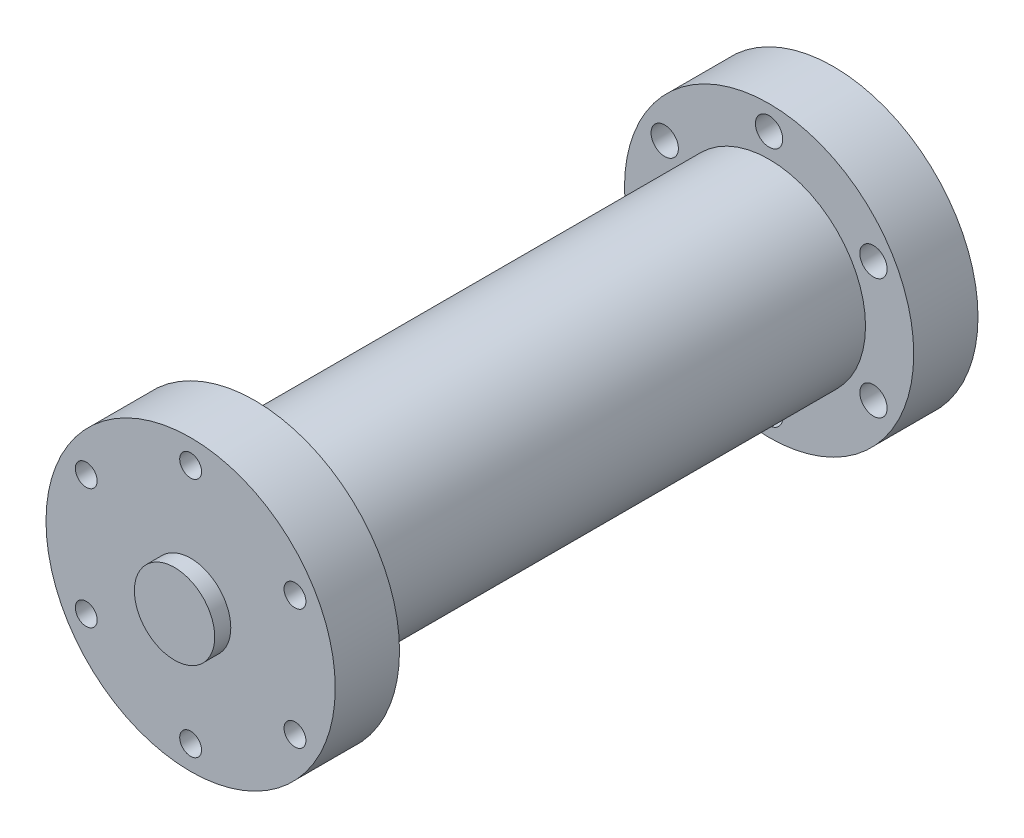
ISO-10303-21;
HEADER;
FILE_DESCRIPTION(('STEP AP214'),'2;1');
FILE_NAME('part.step','',(''),(''),'','','');
FILE_SCHEMA(('AUTOMOTIVE_DESIGN { 1 0 10303 214 1 1 1 1 }'));
ENDSEC;
DATA;
#1=APPLICATION_CONTEXT('core data for automotive mechanical design processes');
#2=APPLICATION_PROTOCOL_DEFINITION('international standard','automotive_design',2000,#1);
#3=PRODUCT_CONTEXT('',#1,'mechanical');
#4=PRODUCT('Part','Part','',(#3));
#5=PRODUCT_RELATED_PRODUCT_CATEGORY('part','',(#4));
#6=PRODUCT_DEFINITION_FORMATION('','',#4);
#7=PRODUCT_DEFINITION_CONTEXT('part definition',#1,'design');
#8=PRODUCT_DEFINITION('design','',#6,#7);
#9=PRODUCT_DEFINITION_SHAPE('','',#8);
#10=(LENGTH_UNIT() NAMED_UNIT(*) SI_UNIT(.MILLI.,.METRE.));
#11=(NAMED_UNIT(*) PLANE_ANGLE_UNIT() SI_UNIT($,.RADIAN.));
#12=(NAMED_UNIT(*) SI_UNIT($,.STERADIAN.) SOLID_ANGLE_UNIT());
#13=UNCERTAINTY_MEASURE_WITH_UNIT(LENGTH_MEASURE(1.E-05),#10,'distance_accuracy_value','');
#14=(GEOMETRIC_REPRESENTATION_CONTEXT(3) GLOBAL_UNCERTAINTY_ASSIGNED_CONTEXT((#13)) GLOBAL_UNIT_ASSIGNED_CONTEXT((#10,
#11,#12)) REPRESENTATION_CONTEXT('',''));
#15=CARTESIAN_POINT('',(0.,0.,0.));
#16=DIRECTION('',(0.,0.,1.));
#17=DIRECTION('',(1.,0.,0.));
#18=AXIS2_PLACEMENT_3D('',#15,#16,#17);
#19=CARTESIAN_POINT('',(0.,0.,20.));
#20=DIRECTION('',(0.,0.,-1.));
#21=DIRECTION('',(-1.,0.,0.));
#22=AXIS2_PLACEMENT_3D('',#19,#20,#21);
#23=CYLINDRICAL_SURFACE('',#22,45.);
#24=CARTESIAN_POINT('',(0.,0.,20.));
#25=DIRECTION('',(0.,0.,1.));
#26=DIRECTION('',(1.,0.,0.));
#27=AXIS2_PLACEMENT_3D('',#24,#25,#26);
#28=CIRCLE('',#27,45.);
#29=CARTESIAN_POINT('',(45.,0.,20.));
#30=VERTEX_POINT('',#29);
#31=EDGE_CURVE('E51',#30,#30,#28,.T.);
#32=ORIENTED_EDGE('',*,*,#31,.F.);
#33=EDGE_LOOP('',(#32));
#34=FACE_BOUND('',#33,.T.);
#35=CARTESIAN_POINT('',(0.,0.,0.));
#36=DIRECTION('',(0.,0.,1.));
#37=DIRECTION('',(1.,0.,0.));
#38=AXIS2_PLACEMENT_3D('',#35,#36,#37);
#39=CIRCLE('',#38,45.);
#40=CARTESIAN_POINT('',(45.,0.,0.));
#41=VERTEX_POINT('',#40);
#42=EDGE_CURVE('E40',#41,#41,#39,.T.);
#43=ORIENTED_EDGE('',*,*,#42,.T.);
#44=EDGE_LOOP('',(#43));
#45=FACE_BOUND('',#44,.T.);
#46=ADVANCED_FACE('F37',(#34,#45),#23,.T.);
#47=CARTESIAN_POINT('',(0.,0.,20.));
#48=DIRECTION('',(0.,0.,1.));
#49=DIRECTION('',(1.,0.,0.));
#50=AXIS2_PLACEMENT_3D('',#47,#48,#49);
#51=PLANE('',#50);
#52=CARTESIAN_POINT('',(32.4759526419162,18.7500000000004,20.));
#53=DIRECTION('',(0.,0.,1.));
#54=DIRECTION('',(1.,0.,0.));
#55=AXIS2_PLACEMENT_3D('',#52,#53,#54);
#56=CIRCLE('',#55,3.4);
#57=CARTESIAN_POINT('',(35.8759526419162,18.7500000000004,20.));
#58=VERTEX_POINT('',#57);
#59=EDGE_CURVE('E358',#58,#58,#56,.T.);
#60=ORIENTED_EDGE('',*,*,#59,.F.);
#61=EDGE_LOOP('',(#60));
#62=FACE_BOUND('',#61,.T.);
#63=CARTESIAN_POINT('',(32.4759526419166,-18.7499999999997,20.));
#64=DIRECTION('',(0.,0.,1.));
#65=DIRECTION('',(1.,0.,0.));
#66=AXIS2_PLACEMENT_3D('',#63,#64,#65);
#67=CIRCLE('',#66,3.4);
#68=CARTESIAN_POINT('',(35.8759526419166,-18.7499999999997,20.));
#69=VERTEX_POINT('',#68);
#70=EDGE_CURVE('E351',#69,#69,#67,.T.);
#71=ORIENTED_EDGE('',*,*,#70,.F.);
#72=EDGE_LOOP('',(#71));
#73=FACE_BOUND('',#72,.T.);
#74=CARTESIAN_POINT('',(0.,-37.5,20.));
#75=DIRECTION('',(0.,0.,1.));
#76=DIRECTION('',(1.,0.,0.));
#77=AXIS2_PLACEMENT_3D('',#74,#75,#76);
#78=CIRCLE('',#77,3.4);
#79=CARTESIAN_POINT('',(3.4,-37.5,20.));
#80=VERTEX_POINT('',#79);
#81=EDGE_CURVE('E343',#80,#80,#78,.T.);
#82=ORIENTED_EDGE('',*,*,#81,.F.);
#83=EDGE_LOOP('',(#82));
#84=FACE_BOUND('',#83,.T.);
#85=CARTESIAN_POINT('',(-32.4759526419164,-18.7500000000002,20.));
#86=DIRECTION('',(0.,0.,1.));
#87=DIRECTION('',(1.,0.,0.));
#88=AXIS2_PLACEMENT_3D('',#85,#86,#87);
#89=CIRCLE('',#88,3.4);
#90=CARTESIAN_POINT('',(-29.0759526419164,-18.7500000000002,20.));
#91=VERTEX_POINT('',#90);
#92=EDGE_CURVE('E335',#91,#91,#89,.T.);
#93=ORIENTED_EDGE('',*,*,#92,.F.);
#94=EDGE_LOOP('',(#93));
#95=FACE_BOUND('',#94,.T.);
#96=CARTESIAN_POINT('',(-32.4759526419165,18.7499999999999,20.));
#97=DIRECTION('',(0.,0.,1.));
#98=DIRECTION('',(1.,0.,0.));
#99=AXIS2_PLACEMENT_3D('',#96,#97,#98);
#100=CIRCLE('',#99,3.4);
#101=CARTESIAN_POINT('',(-29.0759526419165,18.7499999999999,20.));
#102=VERTEX_POINT('',#101);
#103=EDGE_CURVE('E327',#102,#102,#100,.T.);
#104=ORIENTED_EDGE('',*,*,#103,.F.);
#105=EDGE_LOOP('',(#104));
#106=FACE_BOUND('',#105,.T.);
#107=CARTESIAN_POINT('',(0.,37.5,20.));
#108=DIRECTION('',(0.,0.,1.));
#109=DIRECTION('',(1.,0.,0.));
#110=AXIS2_PLACEMENT_3D('',#107,#108,#109);
#111=CIRCLE('',#110,3.4);
#112=CARTESIAN_POINT('',(3.4,37.5,20.));
#113=VERTEX_POINT('',#112);
#114=EDGE_CURVE('E316',#113,#113,#111,.T.);
#115=ORIENTED_EDGE('',*,*,#114,.F.);
#116=EDGE_LOOP('',(#115));
#117=FACE_BOUND('',#116,.T.);
#118=CARTESIAN_POINT('',(0.,0.,20.));
#119=DIRECTION('',(0.,0.,1.));
#120=DIRECTION('',(1.,0.,0.));
#121=AXIS2_PLACEMENT_3D('',#118,#119,#120);
#122=CIRCLE('',#121,12.5);
#123=CARTESIAN_POINT('',(12.5,0.,20.));
#124=VERTEX_POINT('',#123);
#125=EDGE_CURVE('E10',#124,#124,#122,.T.);
#126=ORIENTED_EDGE('',*,*,#125,.F.);
#127=EDGE_LOOP('',(#126));
#128=FACE_BOUND('',#127,.T.);
#129=ORIENTED_EDGE('',*,*,#31,.T.);
#130=EDGE_LOOP('',(#129));
#131=FACE_BOUND('',#130,.T.);
#132=ADVANCED_FACE('F80',(#62,#73,#84,#95,#106,#117,#128,#131),#51,.T.);
#133=CARTESIAN_POINT('',(0.,0.,0.));
#134=DIRECTION('',(0.,0.,1.));
#135=DIRECTION('',(1.,0.,0.));
#136=AXIS2_PLACEMENT_3D('',#133,#134,#135);
#137=PLANE('',#136);
#138=CARTESIAN_POINT('',(32.4759526419162,18.7500000000004,0.));
#139=DIRECTION('',(0.,0.,1.));
#140=DIRECTION('',(1.,0.,0.));
#141=AXIS2_PLACEMENT_3D('',#138,#139,#140);
#142=CIRCLE('',#141,3.39999999999999);
#143=CARTESIAN_POINT('',(35.8759526419162,18.7500000000004,0.));
#144=VERTEX_POINT('',#143);
#145=EDGE_CURVE('E355',#144,#144,#142,.T.);
#146=ORIENTED_EDGE('',*,*,#145,.T.);
#147=EDGE_LOOP('',(#146));
#148=FACE_BOUND('',#147,.T.);
#149=CARTESIAN_POINT('',(32.4759526419166,-18.7499999999997,0.));
#150=DIRECTION('',(0.,0.,1.));
#151=DIRECTION('',(1.,0.,0.));
#152=AXIS2_PLACEMENT_3D('',#149,#150,#151);
#153=CIRCLE('',#152,3.39999999999999);
#154=CARTESIAN_POINT('',(35.8759526419166,-18.7499999999997,0.));
#155=VERTEX_POINT('',#154);
#156=EDGE_CURVE('E347',#155,#155,#153,.T.);
#157=ORIENTED_EDGE('',*,*,#156,.T.);
#158=EDGE_LOOP('',(#157));
#159=FACE_BOUND('',#158,.T.);
#160=CARTESIAN_POINT('',(0.,-37.5,0.));
#161=DIRECTION('',(0.,0.,1.));
#162=DIRECTION('',(1.,0.,0.));
#163=AXIS2_PLACEMENT_3D('',#160,#161,#162);
#164=CIRCLE('',#163,3.39999999999999);
#165=CARTESIAN_POINT('',(3.39999999999999,-37.5,0.));
#166=VERTEX_POINT('',#165);
#167=EDGE_CURVE('E339',#166,#166,#164,.T.);
#168=ORIENTED_EDGE('',*,*,#167,.T.);
#169=EDGE_LOOP('',(#168));
#170=FACE_BOUND('',#169,.T.);
#171=CARTESIAN_POINT('',(-32.4759526419164,-18.7500000000002,0.));
#172=DIRECTION('',(0.,0.,1.));
#173=DIRECTION('',(1.,0.,0.));
#174=AXIS2_PLACEMENT_3D('',#171,#172,#173);
#175=CIRCLE('',#174,3.39999999999998);
#176=CARTESIAN_POINT('',(-29.0759526419164,-18.7500000000002,0.));
#177=VERTEX_POINT('',#176);
#178=EDGE_CURVE('E331',#177,#177,#175,.T.);
#179=ORIENTED_EDGE('',*,*,#178,.T.);
#180=EDGE_LOOP('',(#179));
#181=FACE_BOUND('',#180,.T.);
#182=CARTESIAN_POINT('',(-32.4759526419165,18.7499999999999,0.));
#183=DIRECTION('',(0.,0.,1.));
#184=DIRECTION('',(1.,0.,0.));
#185=AXIS2_PLACEMENT_3D('',#182,#183,#184);
#186=CIRCLE('',#185,3.4);
#187=CARTESIAN_POINT('',(-29.0759526419165,18.7499999999999,0.));
#188=VERTEX_POINT('',#187);
#189=EDGE_CURVE('E321',#188,#188,#186,.T.);
#190=ORIENTED_EDGE('',*,*,#189,.T.);
#191=EDGE_LOOP('',(#190));
#192=FACE_BOUND('',#191,.T.);
#193=CARTESIAN_POINT('',(0.,37.5,0.));
#194=DIRECTION('',(0.,0.,1.));
#195=DIRECTION('',(1.,0.,0.));
#196=AXIS2_PLACEMENT_3D('',#193,#194,#195);
#197=CIRCLE('',#196,3.4);
#198=CARTESIAN_POINT('',(3.4,37.5,0.));
#199=VERTEX_POINT('',#198);
#200=EDGE_CURVE('E313',#199,#199,#197,.T.);
#201=ORIENTED_EDGE('',*,*,#200,.T.);
#202=EDGE_LOOP('',(#201));
#203=FACE_BOUND('',#202,.T.);
#204=CARTESIAN_POINT('',(0.,0.,0.));
#205=DIRECTION('',(0.,0.,-1.));
#206=DIRECTION('',(-1.,0.,0.));
#207=AXIS2_PLACEMENT_3D('',#204,#205,#206);
#208=CIRCLE('',#207,30.);
#209=CARTESIAN_POINT('',(-30.,0.,0.));
#210=VERTEX_POINT('',#209);
#211=EDGE_CURVE('E45',#210,#210,#208,.T.);
#212=ORIENTED_EDGE('',*,*,#211,.F.);
#213=EDGE_LOOP('',(#212));
#214=FACE_BOUND('',#213,.T.);
#215=ORIENTED_EDGE('',*,*,#42,.F.);
#216=EDGE_LOOP('',(#215));
#217=FACE_BOUND('',#216,.T.);
#218=ADVANCED_FACE('F77',(#148,#159,#170,#181,#192,#203,#214,#217),#137,.F.);
#219=CARTESIAN_POINT('',(0.,0.,-160.));
#220=DIRECTION('',(0.,0.,1.));
#221=DIRECTION('',(1.,0.,0.));
#222=AXIS2_PLACEMENT_3D('',#219,#220,#221);
#223=CYLINDRICAL_SURFACE('',#222,30.);
#224=CARTESIAN_POINT('',(0.,0.,-160.));
#225=DIRECTION('',(0.,0.,-1.));
#226=DIRECTION('',(-1.,0.,0.));
#227=AXIS2_PLACEMENT_3D('',#224,#225,#226);
#228=CIRCLE('',#227,30.);
#229=CARTESIAN_POINT('',(-30.,0.,-160.));
#230=VERTEX_POINT('',#229);
#231=EDGE_CURVE('E61',#230,#230,#228,.T.);
#232=ORIENTED_EDGE('',*,*,#231,.F.);
#233=EDGE_LOOP('',(#232));
#234=FACE_BOUND('',#233,.T.);
#235=ORIENTED_EDGE('',*,*,#211,.T.);
#236=EDGE_LOOP('',(#235));
#237=FACE_BOUND('',#236,.T.);
#238=ADVANCED_FACE('F79',(#234,#237),#223,.T.);
#239=CARTESIAN_POINT('',(0.,0.,-180.));
#240=DIRECTION('',(0.,0.,1.));
#241=DIRECTION('',(1.,0.,0.));
#242=AXIS2_PLACEMENT_3D('',#239,#240,#241);
#243=CYLINDRICAL_SURFACE('',#242,45.);
#244=CARTESIAN_POINT('',(0.,0.,-180.));
#245=DIRECTION('',(0.,0.,-1.));
#246=DIRECTION('',(-1.,0.,0.));
#247=AXIS2_PLACEMENT_3D('',#244,#245,#246);
#248=CIRCLE('',#247,45.);
#249=CARTESIAN_POINT('',(-45.,0.,-180.));
#250=VERTEX_POINT('',#249);
#251=EDGE_CURVE('E57',#250,#250,#248,.T.);
#252=ORIENTED_EDGE('',*,*,#251,.F.);
#253=EDGE_LOOP('',(#252));
#254=FACE_BOUND('',#253,.T.);
#255=CARTESIAN_POINT('',(0.,0.,-160.));
#256=DIRECTION('',(0.,0.,-1.));
#257=DIRECTION('',(-1.,0.,0.));
#258=AXIS2_PLACEMENT_3D('',#255,#256,#257);
#259=CIRCLE('',#258,45.);
#260=CARTESIAN_POINT('',(-45.,0.,-160.));
#261=VERTEX_POINT('',#260);
#262=EDGE_CURVE('E62',#261,#261,#259,.T.);
#263=ORIENTED_EDGE('',*,*,#262,.T.);
#264=EDGE_LOOP('',(#263));
#265=FACE_BOUND('',#264,.T.);
#266=ADVANCED_FACE('F86',(#254,#265),#243,.T.);
#267=CARTESIAN_POINT('',(0.,0.,-180.));
#268=DIRECTION('',(0.,0.,-1.));
#269=DIRECTION('',(-1.,0.,0.));
#270=AXIS2_PLACEMENT_3D('',#267,#268,#269);
#271=PLANE('',#270);
#272=CARTESIAN_POINT('',(0.,0.,-180.));
#273=DIRECTION('',(0.,0.,-1.));
#274=DIRECTION('',(-1.,0.,0.));
#275=AXIS2_PLACEMENT_3D('',#272,#273,#274);
#276=CIRCLE('',#275,12.5);
#277=CARTESIAN_POINT('',(-12.5,0.,-180.));
#278=VERTEX_POINT('',#277);
#279=EDGE_CURVE('E411',#278,#278,#276,.T.);
#280=ORIENTED_EDGE('',*,*,#279,.F.);
#281=EDGE_LOOP('',(#280));
#282=FACE_BOUND('',#281,.T.);
#283=CARTESIAN_POINT('',(-32.4759526419162,18.7500000000004,-180.));
#284=DIRECTION('',(0.,0.,-1.));
#285=DIRECTION('',(-1.,0.,0.));
#286=AXIS2_PLACEMENT_3D('',#283,#284,#285);
#287=CIRCLE('',#286,4.25);
#288=CARTESIAN_POINT('',(-36.7259526419162,18.7500000000004,-180.));
#289=VERTEX_POINT('',#288);
#290=EDGE_CURVE('E406',#289,#289,#287,.T.);
#291=ORIENTED_EDGE('',*,*,#290,.F.);
#292=EDGE_LOOP('',(#291));
#293=FACE_BOUND('',#292,.T.);
#294=CARTESIAN_POINT('',(-32.4759526419166,-18.7499999999997,-180.));
#295=DIRECTION('',(0.,0.,-1.));
#296=DIRECTION('',(-1.,0.,0.));
#297=AXIS2_PLACEMENT_3D('',#294,#295,#296);
#298=CIRCLE('',#297,4.25);
#299=CARTESIAN_POINT('',(-36.7259526419166,-18.7499999999997,-180.));
#300=VERTEX_POINT('',#299);
#301=EDGE_CURVE('E398',#300,#300,#298,.T.);
#302=ORIENTED_EDGE('',*,*,#301,.F.);
#303=EDGE_LOOP('',(#302));
#304=FACE_BOUND('',#303,.T.);
#305=CARTESIAN_POINT('',(0.,-37.5,-180.));
#306=DIRECTION('',(0.,0.,-1.));
#307=DIRECTION('',(-1.,0.,0.));
#308=AXIS2_PLACEMENT_3D('',#305,#306,#307);
#309=CIRCLE('',#308,4.25);
#310=CARTESIAN_POINT('',(-4.25,-37.5,-180.));
#311=VERTEX_POINT('',#310);
#312=EDGE_CURVE('E390',#311,#311,#309,.T.);
#313=ORIENTED_EDGE('',*,*,#312,.F.);
#314=EDGE_LOOP('',(#313));
#315=FACE_BOUND('',#314,.T.);
#316=CARTESIAN_POINT('',(32.4759526419164,-18.7500000000002,-180.));
#317=DIRECTION('',(0.,0.,-1.));
#318=DIRECTION('',(-1.,0.,0.));
#319=AXIS2_PLACEMENT_3D('',#316,#317,#318);
#320=CIRCLE('',#319,4.25);
#321=CARTESIAN_POINT('',(28.2259526419164,-18.7500000000002,-180.));
#322=VERTEX_POINT('',#321);
#323=EDGE_CURVE('E382',#322,#322,#320,.T.);
#324=ORIENTED_EDGE('',*,*,#323,.F.);
#325=EDGE_LOOP('',(#324));
#326=FACE_BOUND('',#325,.T.);
#327=CARTESIAN_POINT('',(32.4759526419165,18.7499999999999,-180.));
#328=DIRECTION('',(0.,0.,-1.));
#329=DIRECTION('',(-1.,0.,0.));
#330=AXIS2_PLACEMENT_3D('',#327,#328,#329);
#331=CIRCLE('',#330,4.25);
#332=CARTESIAN_POINT('',(28.2259526419165,18.7499999999999,-180.));
#333=VERTEX_POINT('',#332);
#334=EDGE_CURVE('E374',#333,#333,#331,.T.);
#335=ORIENTED_EDGE('',*,*,#334,.F.);
#336=EDGE_LOOP('',(#335));
#337=FACE_BOUND('',#336,.T.);
#338=CARTESIAN_POINT('',(0.,37.5,-180.));
#339=DIRECTION('',(0.,0.,-1.));
#340=DIRECTION('',(-1.,0.,0.));
#341=AXIS2_PLACEMENT_3D('',#338,#339,#340);
#342=CIRCLE('',#341,4.25);
#343=CARTESIAN_POINT('',(-4.25,37.5,-180.));
#344=VERTEX_POINT('',#343);
#345=EDGE_CURVE('E366',#344,#344,#342,.T.);
#346=ORIENTED_EDGE('',*,*,#345,.F.);
#347=EDGE_LOOP('',(#346));
#348=FACE_BOUND('',#347,.T.);
#349=ORIENTED_EDGE('',*,*,#251,.T.);
#350=EDGE_LOOP('',(#349));
#351=FACE_BOUND('',#350,.T.);
#352=ADVANCED_FACE('F187',(#282,#293,#304,#315,#326,#337,#348,#351),#271,.T.);
#353=CARTESIAN_POINT('',(0.,0.,-160.));
#354=DIRECTION('',(0.,0.,-1.));
#355=DIRECTION('',(-1.,0.,0.));
#356=AXIS2_PLACEMENT_3D('',#353,#354,#355);
#357=PLANE('',#356);
#358=CARTESIAN_POINT('',(-32.4759526419162,18.7500000000004,-160.));
#359=DIRECTION('',(0.,0.,-1.));
#360=DIRECTION('',(-1.,0.,0.));
#361=AXIS2_PLACEMENT_3D('',#358,#359,#360);
#362=CIRCLE('',#361,4.25);
#363=CARTESIAN_POINT('',(-36.7259526419162,18.7500000000004,-160.));
#364=VERTEX_POINT('',#363);
#365=EDGE_CURVE('E402',#364,#364,#362,.T.);
#366=ORIENTED_EDGE('',*,*,#365,.T.);
#367=EDGE_LOOP('',(#366));
#368=FACE_BOUND('',#367,.T.);
#369=CARTESIAN_POINT('',(-32.4759526419166,-18.7499999999997,-160.));
#370=DIRECTION('',(0.,0.,-1.));
#371=DIRECTION('',(-1.,0.,0.));
#372=AXIS2_PLACEMENT_3D('',#369,#370,#371);
#373=CIRCLE('',#372,4.25);
#374=CARTESIAN_POINT('',(-36.7259526419166,-18.7499999999997,-160.));
#375=VERTEX_POINT('',#374);
#376=EDGE_CURVE('E394',#375,#375,#373,.T.);
#377=ORIENTED_EDGE('',*,*,#376,.T.);
#378=EDGE_LOOP('',(#377));
#379=FACE_BOUND('',#378,.T.);
#380=CARTESIAN_POINT('',(0.,-37.5,-160.));
#381=DIRECTION('',(0.,0.,-1.));
#382=DIRECTION('',(-1.,0.,0.));
#383=AXIS2_PLACEMENT_3D('',#380,#381,#382);
#384=CIRCLE('',#383,4.25);
#385=CARTESIAN_POINT('',(-4.25,-37.5,-160.));
#386=VERTEX_POINT('',#385);
#387=EDGE_CURVE('E386',#386,#386,#384,.T.);
#388=ORIENTED_EDGE('',*,*,#387,.T.);
#389=EDGE_LOOP('',(#388));
#390=FACE_BOUND('',#389,.T.);
#391=CARTESIAN_POINT('',(32.4759526419164,-18.7500000000002,-160.));
#392=DIRECTION('',(0.,0.,-1.));
#393=DIRECTION('',(-1.,0.,0.));
#394=AXIS2_PLACEMENT_3D('',#391,#392,#393);
#395=CIRCLE('',#394,4.25);
#396=CARTESIAN_POINT('',(28.2259526419164,-18.7500000000002,-160.));
#397=VERTEX_POINT('',#396);
#398=EDGE_CURVE('E378',#397,#397,#395,.T.);
#399=ORIENTED_EDGE('',*,*,#398,.T.);
#400=EDGE_LOOP('',(#399));
#401=FACE_BOUND('',#400,.T.);
#402=CARTESIAN_POINT('',(32.4759526419165,18.7499999999999,-160.));
#403=DIRECTION('',(0.,0.,-1.));
#404=DIRECTION('',(-1.,0.,0.));
#405=AXIS2_PLACEMENT_3D('',#402,#403,#404);
#406=CIRCLE('',#405,4.25);
#407=CARTESIAN_POINT('',(28.2259526419165,18.7499999999999,-160.));
#408=VERTEX_POINT('',#407);
#409=EDGE_CURVE('E370',#408,#408,#406,.T.);
#410=ORIENTED_EDGE('',*,*,#409,.T.);
#411=EDGE_LOOP('',(#410));
#412=FACE_BOUND('',#411,.T.);
#413=CARTESIAN_POINT('',(0.,37.5,-160.));
#414=DIRECTION('',(0.,0.,-1.));
#415=DIRECTION('',(-1.,0.,0.));
#416=AXIS2_PLACEMENT_3D('',#413,#414,#415);
#417=CIRCLE('',#416,4.25);
#418=CARTESIAN_POINT('',(-4.25,37.5,-160.));
#419=VERTEX_POINT('',#418);
#420=EDGE_CURVE('E362',#419,#419,#417,.T.);
#421=ORIENTED_EDGE('',*,*,#420,.T.);
#422=EDGE_LOOP('',(#421));
#423=FACE_BOUND('',#422,.T.);
#424=ORIENTED_EDGE('',*,*,#231,.T.);
#425=EDGE_LOOP('',(#424));
#426=FACE_BOUND('',#425,.T.);
#427=ORIENTED_EDGE('',*,*,#262,.F.);
#428=EDGE_LOOP('',(#427));
#429=FACE_BOUND('',#428,.T.);
#430=ADVANCED_FACE('F181',(#368,#379,#390,#401,#412,#423,#426,#429),#357,.F.);
#431=CARTESIAN_POINT('',(0.,0.,25.));
#432=DIRECTION('',(0.,0.,-1.));
#433=DIRECTION('',(-1.,0.,0.));
#434=AXIS2_PLACEMENT_3D('',#431,#432,#433);
#435=CYLINDRICAL_SURFACE('',#434,12.5);
#436=CARTESIAN_POINT('',(0.,0.,25.));
#437=DIRECTION('',(0.,0.,1.));
#438=DIRECTION('',(1.,0.,0.));
#439=AXIS2_PLACEMENT_3D('',#436,#437,#438);
#440=CIRCLE('',#439,12.5);
#441=CARTESIAN_POINT('',(12.5,0.,25.));
#442=VERTEX_POINT('',#441);
#443=EDGE_CURVE('E55',#442,#442,#440,.T.);
#444=ORIENTED_EDGE('',*,*,#443,.F.);
#445=EDGE_LOOP('',(#444));
#446=FACE_BOUND('',#445,.T.);
#447=ORIENTED_EDGE('',*,*,#125,.T.);
#448=EDGE_LOOP('',(#447));
#449=FACE_BOUND('',#448,.T.);
#450=ADVANCED_FACE('F186',(#446,#449),#435,.T.);
#451=CARTESIAN_POINT('',(0.,0.,25.));
#452=DIRECTION('',(0.,0.,1.));
#453=DIRECTION('',(1.,0.,0.));
#454=AXIS2_PLACEMENT_3D('',#451,#452,#453);
#455=PLANE('',#454);
#456=ORIENTED_EDGE('',*,*,#443,.T.);
#457=EDGE_LOOP('',(#456));
#458=FACE_BOUND('',#457,.T.);
#459=ADVANCED_FACE('F275',(#458),#455,.T.);
#460=CARTESIAN_POINT('',(0.,37.5,20.));
#461=DIRECTION('',(0.,0.,1.));
#462=DIRECTION('',(1.,0.,0.));
#463=AXIS2_PLACEMENT_3D('',#460,#461,#462);
#464=CYLINDRICAL_SURFACE('',#463,3.4);
#465=ORIENTED_EDGE('',*,*,#200,.F.);
#466=EDGE_LOOP('',(#465));
#467=FACE_BOUND('',#466,.T.);
#468=ORIENTED_EDGE('',*,*,#114,.T.);
#469=EDGE_LOOP('',(#468));
#470=FACE_BOUND('',#469,.T.);
#471=ADVANCED_FACE('F108',(#467,#470),#464,.F.);
#472=CARTESIAN_POINT('',(-32.4759526419165,18.7499999999999,20.));
#473=DIRECTION('',(0.,0.,1.));
#474=DIRECTION('',(1.,0.,0.));
#475=AXIS2_PLACEMENT_3D('',#472,#473,#474);
#476=CYLINDRICAL_SURFACE('',#475,3.4);
#477=ORIENTED_EDGE('',*,*,#189,.F.);
#478=EDGE_LOOP('',(#477));
#479=FACE_BOUND('',#478,.T.);
#480=ORIENTED_EDGE('',*,*,#103,.T.);
#481=EDGE_LOOP('',(#480));
#482=FACE_BOUND('',#481,.T.);
#483=ADVANCED_FACE('F118',(#479,#482),#476,.F.);
#484=CARTESIAN_POINT('',(-32.4759526419164,-18.7500000000002,20.));
#485=DIRECTION('',(0.,0.,1.));
#486=DIRECTION('',(1.,0.,0.));
#487=AXIS2_PLACEMENT_3D('',#484,#485,#486);
#488=CYLINDRICAL_SURFACE('',#487,3.39999999999998);
#489=ORIENTED_EDGE('',*,*,#178,.F.);
#490=EDGE_LOOP('',(#489));
#491=FACE_BOUND('',#490,.T.);
#492=ORIENTED_EDGE('',*,*,#92,.T.);
#493=EDGE_LOOP('',(#492));
#494=FACE_BOUND('',#493,.T.);
#495=ADVANCED_FACE('F123',(#491,#494),#488,.F.);
#496=CARTESIAN_POINT('',(0.,-37.5,20.));
#497=DIRECTION('',(0.,0.,1.));
#498=DIRECTION('',(1.,0.,0.));
#499=AXIS2_PLACEMENT_3D('',#496,#497,#498);
#500=CYLINDRICAL_SURFACE('',#499,3.39999999999999);
#501=ORIENTED_EDGE('',*,*,#167,.F.);
#502=EDGE_LOOP('',(#501));
#503=FACE_BOUND('',#502,.T.);
#504=ORIENTED_EDGE('',*,*,#81,.T.);
#505=EDGE_LOOP('',(#504));
#506=FACE_BOUND('',#505,.T.);
#507=ADVANCED_FACE('F133',(#503,#506),#500,.F.);
#508=CARTESIAN_POINT('',(32.4759526419166,-18.7499999999997,20.));
#509=DIRECTION('',(0.,0.,1.));
#510=DIRECTION('',(1.,0.,0.));
#511=AXIS2_PLACEMENT_3D('',#508,#509,#510);
#512=CYLINDRICAL_SURFACE('',#511,3.39999999999999);
#513=ORIENTED_EDGE('',*,*,#156,.F.);
#514=EDGE_LOOP('',(#513));
#515=FACE_BOUND('',#514,.T.);
#516=ORIENTED_EDGE('',*,*,#70,.T.);
#517=EDGE_LOOP('',(#516));
#518=FACE_BOUND('',#517,.T.);
#519=ADVANCED_FACE('F143',(#515,#518),#512,.F.);
#520=CARTESIAN_POINT('',(32.4759526419162,18.7500000000004,20.));
#521=DIRECTION('',(0.,0.,1.));
#522=DIRECTION('',(1.,0.,0.));
#523=AXIS2_PLACEMENT_3D('',#520,#521,#522);
#524=CYLINDRICAL_SURFACE('',#523,3.39999999999999);
#525=ORIENTED_EDGE('',*,*,#145,.F.);
#526=EDGE_LOOP('',(#525));
#527=FACE_BOUND('',#526,.T.);
#528=ORIENTED_EDGE('',*,*,#59,.T.);
#529=EDGE_LOOP('',(#528));
#530=FACE_BOUND('',#529,.T.);
#531=ADVANCED_FACE('F153',(#527,#530),#524,.F.);
#532=CARTESIAN_POINT('',(0.,37.5,-180.));
#533=DIRECTION('',(0.,0.,-1.));
#534=DIRECTION('',(-1.,0.,0.));
#535=AXIS2_PLACEMENT_3D('',#532,#533,#534);
#536=CYLINDRICAL_SURFACE('',#535,4.25);
#537=ORIENTED_EDGE('',*,*,#420,.F.);
#538=EDGE_LOOP('',(#537));
#539=FACE_BOUND('',#538,.T.);
#540=ORIENTED_EDGE('',*,*,#345,.T.);
#541=EDGE_LOOP('',(#540));
#542=FACE_BOUND('',#541,.T.);
#543=ADVANCED_FACE('F163',(#539,#542),#536,.F.);
#544=CARTESIAN_POINT('',(32.4759526419165,18.7499999999999,-180.));
#545=DIRECTION('',(0.,0.,-1.));
#546=DIRECTION('',(-1.,0.,0.));
#547=AXIS2_PLACEMENT_3D('',#544,#545,#546);
#548=CYLINDRICAL_SURFACE('',#547,4.25);
#549=ORIENTED_EDGE('',*,*,#409,.F.);
#550=EDGE_LOOP('',(#549));
#551=FACE_BOUND('',#550,.T.);
#552=ORIENTED_EDGE('',*,*,#334,.T.);
#553=EDGE_LOOP('',(#552));
#554=FACE_BOUND('',#553,.T.);
#555=ADVANCED_FACE('F173',(#551,#554),#548,.F.);
#556=CARTESIAN_POINT('',(32.4759526419164,-18.7500000000002,-180.));
#557=DIRECTION('',(0.,0.,-1.));
#558=DIRECTION('',(-1.,0.,0.));
#559=AXIS2_PLACEMENT_3D('',#556,#557,#558);
#560=CYLINDRICAL_SURFACE('',#559,4.25);
#561=ORIENTED_EDGE('',*,*,#398,.F.);
#562=EDGE_LOOP('',(#561));
#563=FACE_BOUND('',#562,.T.);
#564=ORIENTED_EDGE('',*,*,#323,.T.);
#565=EDGE_LOOP('',(#564));
#566=FACE_BOUND('',#565,.T.);
#567=ADVANCED_FACE('F199',(#563,#566),#560,.F.);
#568=CARTESIAN_POINT('',(0.,-37.5,-180.));
#569=DIRECTION('',(0.,0.,-1.));
#570=DIRECTION('',(-1.,0.,0.));
#571=AXIS2_PLACEMENT_3D('',#568,#569,#570);
#572=CYLINDRICAL_SURFACE('',#571,4.25);
#573=ORIENTED_EDGE('',*,*,#387,.F.);
#574=EDGE_LOOP('',(#573));
#575=FACE_BOUND('',#574,.T.);
#576=ORIENTED_EDGE('',*,*,#312,.T.);
#577=EDGE_LOOP('',(#576));
#578=FACE_BOUND('',#577,.T.);
#579=ADVANCED_FACE('F209',(#575,#578),#572,.F.);
#580=CARTESIAN_POINT('',(-32.4759526419166,-18.7499999999997,-180.));
#581=DIRECTION('',(0.,0.,-1.));
#582=DIRECTION('',(-1.,0.,0.));
#583=AXIS2_PLACEMENT_3D('',#580,#581,#582);
#584=CYLINDRICAL_SURFACE('',#583,4.25);
#585=ORIENTED_EDGE('',*,*,#376,.F.);
#586=EDGE_LOOP('',(#585));
#587=FACE_BOUND('',#586,.T.);
#588=ORIENTED_EDGE('',*,*,#301,.T.);
#589=EDGE_LOOP('',(#588));
#590=FACE_BOUND('',#589,.T.);
#591=ADVANCED_FACE('F219',(#587,#590),#584,.F.);
#592=CARTESIAN_POINT('',(-32.4759526419162,18.7500000000004,-180.));
#593=DIRECTION('',(0.,0.,-1.));
#594=DIRECTION('',(-1.,0.,0.));
#595=AXIS2_PLACEMENT_3D('',#592,#593,#594);
#596=CYLINDRICAL_SURFACE('',#595,4.25);
#597=ORIENTED_EDGE('',*,*,#365,.F.);
#598=EDGE_LOOP('',(#597));
#599=FACE_BOUND('',#598,.T.);
#600=ORIENTED_EDGE('',*,*,#290,.T.);
#601=EDGE_LOOP('',(#600));
#602=FACE_BOUND('',#601,.T.);
#603=ADVANCED_FACE('F229',(#599,#602),#596,.F.);
#604=CARTESIAN_POINT('',(0.,0.,-120.));
#605=DIRECTION('',(0.,0.,-1.));
#606=DIRECTION('',(-1.,0.,0.));
#607=AXIS2_PLACEMENT_3D('',#604,#605,#606);
#608=CYLINDRICAL_SURFACE('',#607,12.5);
#609=CARTESIAN_POINT('',(0.,0.,-120.));
#610=DIRECTION('',(0.,0.,-1.));
#611=DIRECTION('',(-1.,0.,0.));
#612=AXIS2_PLACEMENT_3D('',#609,#610,#611);
#613=CIRCLE('',#612,12.5);
#614=CARTESIAN_POINT('',(-12.5,0.,-120.));
#615=VERTEX_POINT('',#614);
#616=EDGE_CURVE('E410',#615,#615,#613,.T.);
#617=ORIENTED_EDGE('',*,*,#616,.F.);
#618=EDGE_LOOP('',(#617));
#619=FACE_BOUND('',#618,.T.);
#620=ORIENTED_EDGE('',*,*,#279,.T.);
#621=EDGE_LOOP('',(#620));
#622=FACE_BOUND('',#621,.T.);
#623=ADVANCED_FACE('F239',(#619,#622),#608,.F.);
#624=CARTESIAN_POINT('',(0.,0.,-120.));
#625=DIRECTION('',(0.,0.,-1.));
#626=DIRECTION('',(-1.,0.,0.));
#627=AXIS2_PLACEMENT_3D('',#624,#625,#626);
#628=PLANE('',#627);
#629=ORIENTED_EDGE('',*,*,#616,.T.);
#630=EDGE_LOOP('',(#629));
#631=FACE_BOUND('',#630,.T.);
#632=ADVANCED_FACE('F258',(#631),#628,.T.);
#633=CLOSED_SHELL('',(#46,#132,#218,#238,#266,#352,#430,#450,#459,#471,#483,#495,#507,#519,#531,
#543,#555,#567,#579,#591,#603,#623,#632));
#634=MANIFOLD_SOLID_BREP('B2',#633);
#635=ADVANCED_BREP_SHAPE_REPRESENTATION('',(#18,#634),#14);
#636=SHAPE_DEFINITION_REPRESENTATION(#9,#635);
ENDSEC;
END-ISO-10303-21;
